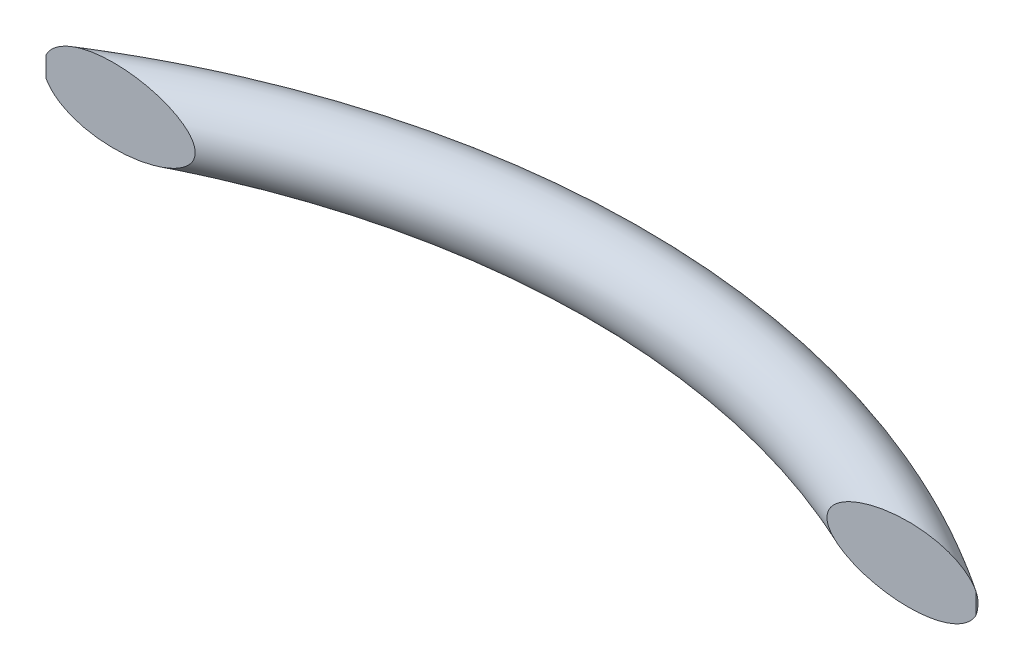
ISO-10303-21;
HEADER;
FILE_DESCRIPTION(('STEP AP214'),'2;1');
FILE_NAME('part.step','',(''),(''),'','','');
FILE_SCHEMA(('AUTOMOTIVE_DESIGN { 1 0 10303 214 1 1 1 1 }'));
ENDSEC;
DATA;
#1=APPLICATION_CONTEXT('core data for automotive mechanical design processes');
#2=APPLICATION_PROTOCOL_DEFINITION('international standard','automotive_design',2000,#1);
#3=PRODUCT_CONTEXT('',#1,'mechanical');
#4=PRODUCT('Part','Part','',(#3));
#5=PRODUCT_RELATED_PRODUCT_CATEGORY('part','',(#4));
#6=PRODUCT_DEFINITION_FORMATION('','',#4);
#7=PRODUCT_DEFINITION_CONTEXT('part definition',#1,'design');
#8=PRODUCT_DEFINITION('design','',#6,#7);
#9=PRODUCT_DEFINITION_SHAPE('','',#8);
#10=(LENGTH_UNIT() NAMED_UNIT(*) SI_UNIT(.MILLI.,.METRE.));
#11=(NAMED_UNIT(*) PLANE_ANGLE_UNIT() SI_UNIT($,.RADIAN.));
#12=(NAMED_UNIT(*) SI_UNIT($,.STERADIAN.) SOLID_ANGLE_UNIT());
#13=UNCERTAINTY_MEASURE_WITH_UNIT(LENGTH_MEASURE(1.E-05),#10,'distance_accuracy_value','');
#14=(GEOMETRIC_REPRESENTATION_CONTEXT(3) GLOBAL_UNCERTAINTY_ASSIGNED_CONTEXT((#13)) GLOBAL_UNIT_ASSIGNED_CONTEXT((#10,
#11,#12)) REPRESENTATION_CONTEXT('',''));
#15=CARTESIAN_POINT('',(0.,0.,0.));
#16=DIRECTION('',(0.,0.,1.));
#17=DIRECTION('',(1.,0.,0.));
#18=AXIS2_PLACEMENT_3D('',#15,#16,#17);
#19=CARTESIAN_POINT('',(-152.4,0.,227.828924436552));
#20=DIRECTION('',(0.,-1.,0.));
#21=DIRECTION('',(0.,0.,-1.));
#22=AXIS2_PLACEMENT_3D('',#19,#20,#21);
#23=TOROIDAL_SURFACE('',#22,274.101767250626,12.7);
#24=CARTESIAN_POINT('',(0.,0.,0.));
#25=DIRECTION('',(0.831183712245956,0.,0.555997874543627));
#26=DIRECTION('',(0.555997874543627,0.,-0.831183712245956));
#27=AXIS2_PLACEMENT_3D('',#24,#25,#26);
#28=CIRCLE('',#27,12.7);
#29=CARTESIAN_POINT('',(6.79625734014825,-3.44605370916953,-10.16));
#30=VERTEX_POINT('',#29);
#31=CARTESIAN_POINT('',(6.79625734014825,3.44605370916953,-10.16));
#32=VERTEX_POINT('',#31);
#33=EDGE_CURVE('E66',#30,#32,#28,.T.);
#34=ORIENTED_EDGE('',*,*,#33,.F.);
#35=CARTESIAN_POINT('',(-43.9860659170304,1.72332040623584,-10.16));
#36=CARTESIAN_POINT('',(-43.9151591368676,1.93793154993896,-10.16));
#37=CARTESIAN_POINT('',(-43.8321098359539,2.1485509703383,-10.16));
#38=CARTESIAN_POINT('',(-43.6450618763338,2.56038122716442,-10.16));
#39=CARTESIAN_POINT('',(-43.54104255287,2.76158253969163,-10.16));
#40=CARTESIAN_POINT('',(-43.3148902823946,3.15474442453064,-10.16));
#41=CARTESIAN_POINT('',(-43.1926727492721,3.34665598124634,-10.16));
#42=CARTESIAN_POINT('',(-42.9335346727936,3.72014091763113,-10.16));
#43=CARTESIAN_POINT('',(-42.7966162587733,3.90171578869359,-10.16));
#44=CARTESIAN_POINT('',(-42.4334334218054,4.35024692050321,-10.16));
#45=CARTESIAN_POINT('',(-42.1988085997777,4.61043564554948,-10.16));
#46=CARTESIAN_POINT('',(-41.7078314749956,5.10943785089926,-10.16));
#47=CARTESIAN_POINT('',(-41.451464040657,5.34823620312978,-10.16));
#48=CARTESIAN_POINT('',(-40.9219775957131,5.80680228364425,-10.16));
#49=CARTESIAN_POINT('',(-40.6488447892655,6.026553970308,-10.16));
#50=CARTESIAN_POINT('',(-40.0897632927793,6.44885281882681,-10.16));
#51=CARTESIAN_POINT('',(-39.8038170667507,6.6514032669607,-10.16));
#52=CARTESIAN_POINT('',(-39.2121100693396,7.04760669286929,-10.16));
#53=CARTESIAN_POINT('',(-38.9060068227333,7.24074569657723,-10.16));
#54=CARTESIAN_POINT('',(-38.2849950425226,7.61239038647729,-10.16));
#55=CARTESIAN_POINT('',(-37.9700846038726,7.79089287335898,-10.16));
#56=CARTESIAN_POINT('',(-37.3328535605271,8.13475925411668,-10.16));
#57=CARTESIAN_POINT('',(-37.0105269241695,8.30011192834147,-10.16));
#58=CARTESIAN_POINT('',(-36.3599647278674,8.61865275857517,-10.16));
#59=CARTESIAN_POINT('',(-36.0317295628914,8.77184172401665,-10.16));
#60=CARTESIAN_POINT('',(-35.3694114108312,9.06740573493296,-10.16));
#61=CARTESIAN_POINT('',(-35.035315417285,9.20975156976785,-10.16));
#62=CARTESIAN_POINT('',(-34.3628702995066,9.48396818006798,-10.16));
#63=CARTESIAN_POINT('',(-34.024521161244,9.61583892096744,-10.16));
#64=CARTESIAN_POINT('',(-33.0042545251264,9.99666502218188,-10.16));
#65=CARTESIAN_POINT('',(-32.3168260211258,10.230962729269,-10.16));
#66=CARTESIAN_POINT('',(-30.9563142608716,10.6564644772912,-10.16));
#67=CARTESIAN_POINT('',(-30.2836195026654,10.8489265830219,-10.16));
#68=CARTESIAN_POINT('',(-28.9302064191093,11.2035965730994,-10.16));
#69=CARTESIAN_POINT('',(-28.2494868486793,11.3657996951781,-10.16));
#70=CARTESIAN_POINT('',(-26.8813206774544,11.6616384734943,-10.16));
#71=CARTESIAN_POINT('',(-26.1938690962563,11.7952509957207,-10.16));
#72=CARTESIAN_POINT('',(-24.8142003671041,12.0347326494216,-10.16));
#73=CARTESIAN_POINT('',(-24.121983479051,12.1406032818334,-10.16));
#74=CARTESIAN_POINT('',(-22.7337397814987,12.325135553889,-10.16));
#75=CARTESIAN_POINT('',(-22.0377119564872,12.403789542774,-10.16));
#76=CARTESIAN_POINT('',(-20.6431014339891,12.5339243707856,-10.16));
#77=CARTESIAN_POINT('',(-19.9445186597025,12.5854043862097,-10.16));
#78=CARTESIAN_POINT('',(-18.5462797510817,12.6608577268042,-10.16));
#79=CARTESIAN_POINT('',(-17.8466245255034,12.6848477272,-10.16));
#80=CARTESIAN_POINT('',(-16.4469871785259,12.7046953086743,-10.16));
#81=CARTESIAN_POINT('',(-15.7470050838209,12.7005548842434,-10.16));
#82=CARTESIAN_POINT('',(-14.0909133584659,12.656244594436,-10.16));
#83=CARTESIAN_POINT('',(-13.1350805207458,12.6034101431366,-10.16));
#84=CARTESIAN_POINT('',(-11.7051292411154,12.4803525552711,-10.16));
#85=CARTESIAN_POINT('',(-11.2290389659515,12.4320215828035,-10.16));
#86=CARTESIAN_POINT('',(-10.2786675832716,12.3200854693027,-10.16));
#87=CARTESIAN_POINT('',(-9.80438634305612,12.2564814713773,-10.16));
#88=CARTESIAN_POINT('',(-8.85948481264155,12.1134298444174,-10.16));
#89=CARTESIAN_POINT('',(-8.38885818638365,12.0340241626565,-10.16));
#90=CARTESIAN_POINT('',(-7.45075610069653,11.8583762637566,-10.16));
#91=CARTESIAN_POINT('',(-6.98328055648004,11.7621345015252,-10.16));
#92=CARTESIAN_POINT('',(-6.05261034574045,11.5518292385272,-10.16));
#93=CARTESIAN_POINT('',(-5.58941344801258,11.4377756551907,-10.16));
#94=CARTESIAN_POINT('',(-4.66807265734835,11.1905781470397,-10.16));
#95=CARTESIAN_POINT('',(-4.20992928124423,11.0574322887674,-10.16));
#96=CARTESIAN_POINT('',(-3.26330400623098,10.7590449525582,-10.16));
#97=CARTESIAN_POINT('',(-2.77536184941966,10.5920793998648,-10.16));
#98=CARTESIAN_POINT('',(-1.80924922340093,10.2321239940231,-10.16));
#99=CARTESIAN_POINT('',(-1.33107642105726,10.0391404402214,-10.16));
#100=CARTESIAN_POINT('',(-0.387116209137769,9.62459139171867,-10.16));
#101=CARTESIAN_POINT('',(0.0786690884554549,9.40302106037643,-10.16));
#102=CARTESIAN_POINT('',(0.993954165619388,8.92844092142951,-10.16));
#103=CARTESIAN_POINT('',(1.44345821880779,8.67543944247946,-10.16));
#104=CARTESIAN_POINT('',(2.20616281472828,8.20546787058969,-10.16));
#105=CARTESIAN_POINT('',(2.52423600141944,7.99640816071473,-10.16));
#106=CARTESIAN_POINT('',(3.14607293591456,7.55782515858815,-10.16));
#107=CARTESIAN_POINT('',(3.44983550674207,7.32830018764635,-10.16));
#108=CARTESIAN_POINT('',(4.03913091252961,6.84765407947948,-10.16));
#109=CARTESIAN_POINT('',(4.32469137692471,6.59656710084721,-10.16));
#110=CARTESIAN_POINT('',(4.87351980862472,6.07135066389732,-10.16));
#111=CARTESIAN_POINT('',(5.13679822557976,5.79723212827661,-10.16));
#112=CARTESIAN_POINT('',(5.718945835868,5.12926750741816,-10.16));
#113=CARTESIAN_POINT('',(6.02723683300713,4.72589401658429,-10.16));
#114=CARTESIAN_POINT('',(6.44027366497001,4.08932573260781,-10.16));
#115=CARTESIAN_POINT('',(6.56969653159626,3.87193570954763,-10.16));
#116=CARTESIAN_POINT('',(6.80987732888779,3.42700932899236,-10.16));
#117=CARTESIAN_POINT('',(6.92063849776986,3.19947474048685,-10.16));
#118=CARTESIAN_POINT('',(7.10437978437762,2.77394179718461,-10.16));
#119=CARTESIAN_POINT('',(7.18057984764729,2.57733083948272,-10.16));
#120=CARTESIAN_POINT('',(7.31698964363037,2.17864952774648,-10.16));
#121=CARTESIAN_POINT('',(7.37720276069435,1.97658033918527,-10.16));
#122=CARTESIAN_POINT('',(7.48043746063096,1.56818798458004,-10.16));
#123=CARTESIAN_POINT('',(7.52346775031487,1.36186702885322,-10.16));
#124=CARTESIAN_POINT('',(7.59145203579069,0.946251282761808,-10.16));
#125=CARTESIAN_POINT('',(7.61640591323013,0.736956472935529,-10.16));
#126=CARTESIAN_POINT('',(7.64771267370316,0.316292588106167,-10.16));
#127=CARTESIAN_POINT('',(7.65400521402432,0.104918996733764,-10.16));
#128=CARTESIAN_POINT('',(7.64766802248694,-0.317543288550641,-10.16));
#129=CARTESIAN_POINT('',(7.63503824014096,-0.528631981700991,-10.16));
#130=CARTESIAN_POINT('',(7.59114963245554,-0.948911372590826,-10.16));
#131=CARTESIAN_POINT('',(7.55988574535755,-1.15810153893468,-10.16));
#132=CARTESIAN_POINT('',(7.47943638038491,-1.57299086606787,-10.16));
#133=CARTESIAN_POINT('',(7.43025082624511,-1.77869001199737,-10.16));
#134=CARTESIAN_POINT('',(7.31745148494481,-2.17662764522463,-10.16));
#135=CARTESIAN_POINT('',(7.25454062032346,-2.36906647544918,-10.16));
#136=CARTESIAN_POINT('',(7.11434206300426,-2.74866256805793,-10.16));
#137=CARTESIAN_POINT('',(7.03704994216359,-2.93581818318595,-10.16));
#138=CARTESIAN_POINT('',(6.78544387767614,-3.48814819229802,-10.16));
#139=CARTESIAN_POINT('',(6.59134224444772,-3.84438357017858,-10.16));
#140=CARTESIAN_POINT('',(6.03509730244911,-4.72844919594624,-10.16));
#141=CARTESIAN_POINT('',(5.64077317107057,-5.23601953946797,-10.16));
#142=CARTESIAN_POINT('',(4.99396751643365,-5.94579250739507,-10.16));
#143=CARTESIAN_POINT('',(4.76870032189221,-6.17414250894897,-10.16));
#144=CARTESIAN_POINT('',(4.30259082411884,-6.61445240460085,-10.16));
#145=CARTESIAN_POINT('',(4.06174901990023,-6.82641282334675,-10.16));
#146=CARTESIAN_POINT('',(3.41264316813798,-7.36227525633257,-10.16));
#147=CARTESIAN_POINT('',(2.99380347426541,-7.67336156260666,-10.16));
#148=CARTESIAN_POINT('',(2.13073390938118,-8.25814274724838,-10.16));
#149=CARTESIAN_POINT('',(1.68648780954418,-8.53181333856054,-10.16));
#150=CARTESIAN_POINT('',(0.778309351503332,-9.04562983239116,-10.16));
#151=CARTESIAN_POINT('',(0.314349822632633,-9.28572736954457,-10.16));
#152=CARTESIAN_POINT('',(-0.628059494106528,-9.73516567913688,-10.16));
#153=CARTESIAN_POINT('',(-1.10650748041298,-9.94451025675432,-10.16));
#154=CARTESIAN_POINT('',(-2.02400046254638,-10.3148560522205,-10.16));
#155=CARTESIAN_POINT('',(-2.46193818175549,-10.478623064942,-10.16));
#156=CARTESIAN_POINT('',(-3.34503894760928,-10.7855175238214,-10.16));
#157=CARTESIAN_POINT('',(-3.79020313735707,-10.928641668532,-10.16));
#158=CARTESIAN_POINT('',(-4.6865097219152,-11.1957843525788,-10.16));
#159=CARTESIAN_POINT('',(-5.13765574009842,-11.3197906782179,-10.16));
#160=CARTESIAN_POINT('',(-6.0444594921957,-11.5498565831517,-10.16));
#161=CARTESIAN_POINT('',(-6.50011702273078,-11.6559169675853,-10.16));
#162=CARTESIAN_POINT('',(-7.41611811749422,-11.8514270197025,-10.16));
#163=CARTESIAN_POINT('',(-7.87647031625837,-11.9408361240628,-10.16));
#164=CARTESIAN_POINT('',(-8.79996495176496,-12.1036606180845,-10.16));
#165=CARTESIAN_POINT('',(-9.26310738841545,-12.177076008273,-10.16));
#166=CARTESIAN_POINT('',(-10.6555192693163,-12.3745460854123,-10.16));
#167=CARTESIAN_POINT('',(-11.5880956005148,-12.475892067429,-10.16));
#168=CARTESIAN_POINT('',(-13.2514662198607,-12.6068183632712,-10.16));
#169=CARTESIAN_POINT('',(-13.981459421815,-12.6472893163541,-10.16));
#170=CARTESIAN_POINT('',(-15.4426089338217,-12.6961881279556,-10.16));
#171=CARTESIAN_POINT('',(-16.1737653559314,-12.7046126855479,-10.16));
#172=CARTESIAN_POINT('',(-17.6362714000023,-12.6906667824738,-10.16));
#173=CARTESIAN_POINT('',(-18.3676207995576,-12.6682747842187,-10.16));
#174=CARTESIAN_POINT('',(-19.8287490050975,-12.5934690176149,-10.16));
#175=CARTESIAN_POINT('',(-20.5585278722671,-12.541056440868,-10.16));
#176=CARTESIAN_POINT('',(-22.0150174806248,-12.4066128324297,-10.16));
#177=CARTESIAN_POINT('',(-22.7417294616108,-12.3245952248807,-10.16));
#178=CARTESIAN_POINT('',(-24.191227981182,-12.1308487163243,-10.16));
#179=CARTESIAN_POINT('',(-24.9140143132268,-12.0191182671921,-10.16));
#180=CARTESIAN_POINT('',(-26.3536954895575,-11.7654587592351,-10.16));
#181=CARTESIAN_POINT('',(-27.070594524778,-11.6235535487301,-10.16));
#182=CARTESIAN_POINT('',(-28.4973750175534,-11.3083313549272,-10.16));
#183=CARTESIAN_POINT('',(-29.2072575083119,-11.135019071316,-10.16));
#184=CARTESIAN_POINT('',(-30.6035063538969,-10.7589593528693,-10.16));
#185=CARTESIAN_POINT('',(-31.2900556892424,-10.5568931390033,-10.16));
#186=CARTESIAN_POINT('',(-32.6521715438723,-10.117997219913,-10.16));
#187=CARTESIAN_POINT('',(-33.3277368071272,-9.88116356965441,-10.16));
#188=CARTESIAN_POINT('',(-34.3288884313763,-9.49725671089733,-10.16));
#189=CARTESIAN_POINT('',(-34.6600910034282,-9.3647292391337,-10.16));
#190=CARTESIAN_POINT('',(-35.3181743863455,-9.08936977961431,-10.16));
#191=CARTESIAN_POINT('',(-35.645055529188,-8.94653858890931,-10.16));
#192=CARTESIAN_POINT('',(-36.2936187970556,-8.64984321118786,-10.16));
#193=CARTESIAN_POINT('',(-36.6153030240662,-8.4959836290265,-10.16));
#194=CARTESIAN_POINT('',(-37.2526116460362,-8.17624183920367,-10.16));
#195=CARTESIAN_POINT('',(-37.5682368162793,-8.01036118283892,-10.16));
#196=CARTESIAN_POINT('',(-38.1696371364296,-7.67789074898923,-10.16));
#197=CARTESIAN_POINT('',(-38.455919570099,-7.51222092313592,-10.16));
#198=CARTESIAN_POINT('',(-39.0209354955231,-7.16842037594594,-10.16));
#199=CARTESIAN_POINT('',(-39.2996689873005,-6.99028965464676,-10.16));
#200=CARTESIAN_POINT('',(-39.8482005013995,-6.62004297108496,-10.16));
#201=CARTESIAN_POINT('',(-40.1179877780416,-6.42791101788665,-10.16));
#202=CARTESIAN_POINT('',(-40.6459864948139,-6.02831685388584,-10.16));
#203=CARTESIAN_POINT('',(-40.9041996265921,-5.82085689520199,-10.16));
#204=CARTESIAN_POINT('',(-41.3641100519765,-5.42486129904529,-10.16));
#205=CARTESIAN_POINT('',(-41.5680508896162,-5.23893977847515,-10.16));
#206=CARTESIAN_POINT('',(-41.9633977657434,-4.8540686044674,-10.16));
#207=CARTESIAN_POINT('',(-42.15480163233,-4.65511670552772,-10.16));
#208=CARTESIAN_POINT('',(-42.5214883110327,-4.24359456819732,-10.16));
#209=CARTESIAN_POINT('',(-42.6968085710012,-4.03105802542519,-10.16));
#210=CARTESIAN_POINT('',(-43.0276990270036,-3.59130080185747,-10.16));
#211=CARTESIAN_POINT('',(-43.1832823005549,-3.36408999630349,-10.16));
#212=CARTESIAN_POINT('',(-43.5028854383104,-2.84023267986361,-10.16));
#213=CARTESIAN_POINT('',(-43.6606345785675,-2.53962474375462,-10.16));
#214=CARTESIAN_POINT('',(-43.8608766635043,-2.07330315090117,-10.16));
#215=CARTESIAN_POINT('',(-43.9215629059352,-1.91528464633724,-10.16));
#216=CARTESIAN_POINT('',(-44.0294345039723,-1.59473455231035,-10.16));
#217=CARTESIAN_POINT('',(-44.0766265351106,-1.43220523813565,-10.16));
#218=CARTESIAN_POINT('',(-44.1566722736449,-1.10180453778704,-10.16));
#219=CARTESIAN_POINT('',(-44.1893684838876,-0.933894761705609,-10.16));
#220=CARTESIAN_POINT('',(-44.2386701362728,-0.595699097844061,-10.16));
#221=CARTESIAN_POINT('',(-44.2552746549825,-0.425413074270108,-10.16));
#222=CARTESIAN_POINT('',(-44.2718215472464,-0.0841911405027359,-10.16));
#223=CARTESIAN_POINT('',(-44.2717798815232,0.0867439900169605,-10.16));
#224=CARTESIAN_POINT('',(-44.2550789739346,0.427729706837518,-10.16));
#225=CARTESIAN_POINT('',(-44.2384260501569,0.597780604736662,-10.16));
#226=CARTESIAN_POINT('',(-44.1900079065459,0.929112271993255,-10.16));
#227=CARTESIAN_POINT('',(-44.1588395383276,1.09048112232215,-10.16));
#228=CARTESIAN_POINT('',(-44.0825927088192,1.40970554847333,-10.16));
#229=CARTESIAN_POINT('',(-44.037527211974,1.5675642523262,-10.16));
#230=CARTESIAN_POINT('',(-43.9860659170304,1.72332040623584,-10.16));
#231=B_SPLINE_CURVE_WITH_KNOTS('',3,(#35,#36,#37,#38,#39,#40,#41,#42,#43,#44,#45,#46,#47,#48,
#49,#50,#51,#52,#53,#54,#55,#56,#57,#58,#59,#60,#61,#62,#63,#64,#65,#66,#67,#68,#69,#70,#71,#72,
#73,#74,#75,#76,#77,#78,#79,#80,#81,#82,#83,#84,#85,#86,#87,#88,#89,#90,#91,#92,#93,#94,#95,#96,
#97,#98,#99,#100,#101,#102,#103,#104,#105,#106,#107,#108,#109,#110,#111,#112,#113,#114,#115,
#116,#117,#118,#119,#120,#121,#122,#123,#124,#125,#126,#127,#128,#129,#130,#131,#132,#133,#134,
#135,#136,#137,#138,#139,#140,#141,#142,#143,#144,#145,#146,#147,#148,#149,#150,#151,#152,#153,
#154,#155,#156,#157,#158,#159,#160,#161,#162,#163,#164,#165,#166,#167,#168,#169,#170,#171,#172,
#173,#174,#175,#176,#177,#178,#179,#180,#181,#182,#183,#184,#185,#186,#187,#188,#189,#190,#191,
#192,#193,#194,#195,#196,#197,#198,#199,#200,#201,#202,#203,#204,#205,#206,#207,#208,#209,#210,
#211,#212,#213,#214,#215,#216,#217,#218,#219,#220,#221,#222,#223,#224,#225,#226,#227,#228,#229,
#230),.UNSPECIFIED.,.T.,.F.,(4,2,2,2,2,2,2,2,2,2,2,2,2,2,2,2,2,2,2,2,2,2,2,2,2,2,2,2,2,2,2,2,2,
2,2,2,2,2,2,2,2,2,2,2,2,2,2,2,2,2,2,2,2,2,2,2,2,2,2,2,2,2,2,2,2,2,2,2,2,2,2,2,2,2,2,2,2,2,2,2,2,
2,2,2,2,2,2,2,2,2,2,2,2,2,2,2,2,4),(0.,0.677819836138931,1.35631091903076,2.03806023873624,
2.71971094396366,3.76899850988894,4.81902240681276,5.86992223888205,6.92062084382111,
8.00598212527661,9.09158002054046,10.1780944451543,11.264536507094,12.3538088286615,
13.4430847444679,15.6206816410561,17.7190231735498,19.8176946724992,21.9180579380391,
24.0183075428047,26.1191470614099,28.2200502573899,30.3196783863942,32.4191576500771,
35.2891108480311,36.724528530677,38.1598388131056,39.5913885509409,41.0228996145551,
42.4536164513947,43.8844782781364,45.430955101648,46.97705817019,48.523423170186,
50.0693792834569,51.2105580697711,52.3518305490546,53.4913272468848,54.630286557088,
56.1475210701953,56.9058082809772,57.6639637763617,58.2959288781209,58.9277600894035,
59.559270734279,60.1907855138337,60.8243401251432,61.4578964268687,62.091624905984,
62.7253560819443,63.3321236763693,63.9390784111454,65.1523756132398,67.0691207341605,
68.030883972735,68.9926164114932,70.5553195149947,72.1190322227695,73.6849749059436,
75.2507236656831,76.6528486437959,78.0551976179544,79.4584388233381,80.8616170560409,
82.2681700220115,83.6747229416303,86.4868428701518,88.6795362766408,90.8724555345418,
93.0669081950062,95.2612737574565,97.4546455514139,99.6481316487782,101.839890547404,
104.031321746365,106.177530983973,108.323983938801,109.39404299195,110.464019358577,
111.533551535091,112.602945935458,113.594954909211,114.586963879979,115.580124147542,
116.57313878078,117.400544388178,118.228092958009,119.05366304184,119.878683222425,
120.893206744859,121.400527849238,121.907597547985,122.420049075363,122.932530008379,
123.444519564743,123.956314460241,124.448706854302,124.940641284634),.UNSPECIFIED.);
#232=EDGE_CURVE('E56',#30,#32,#231,.T.);
#233=ORIENTED_EDGE('',*,*,#232,.T.);
#234=EDGE_LOOP('',(#34,#233));
#235=FACE_BOUND('',#234,.T.);
#236=CARTESIAN_POINT('',(-304.8,0.,0.));
#237=DIRECTION('',(0.831183712245956,0.,-0.555997874543628));
#238=DIRECTION('',(-0.555997874543628,0.,-0.831183712245956));
#239=AXIS2_PLACEMENT_3D('',#236,#237,#238);
#240=CIRCLE('',#239,12.7);
#241=CARTESIAN_POINT('',(-311.596257340148,-3.44605370916948,-10.16));
#242=VERTEX_POINT('',#241);
#243=CARTESIAN_POINT('',(-311.596257340148,3.44605370916948,-10.16));
#244=VERTEX_POINT('',#243);
#245=EDGE_CURVE('E43',#242,#244,#240,.T.);
#246=ORIENTED_EDGE('',*,*,#245,.T.);
#247=CARTESIAN_POINT('',(-306.366070989677,-8.59581999438654,-10.16));
#248=CARTESIAN_POINT('',(-306.702633814368,-8.39698533019598,-10.16));
#249=CARTESIAN_POINT('',(-307.033435855686,-8.1883887763751,-10.16));
#250=CARTESIAN_POINT('',(-307.680850323093,-7.75005868059673,-10.16));
#251=CARTESIAN_POINT('',(-307.997462023884,-7.52032406005558,-10.16));
#252=CARTESIAN_POINT('',(-308.612474477266,-7.0385066157049,-10.16));
#253=CARTESIAN_POINT('',(-308.910903531663,-6.78646010333964,-10.16));
#254=CARTESIAN_POINT('',(-309.485567630244,-6.25821670825318,-10.16));
#255=CARTESIAN_POINT('',(-309.761812845373,-5.98203101567727,-10.16));
#256=CARTESIAN_POINT('',(-310.19731498733,-5.5025065190272,-10.16));
#257=CARTESIAN_POINT('',(-310.364436429484,-5.30629040863854,-10.16));
#258=CARTESIAN_POINT('',(-310.68464152879,-4.90258323197704,-10.16));
#259=CARTESIAN_POINT('',(-310.83772215217,-4.69508974437393,-10.16));
#260=CARTESIAN_POINT('',(-311.127454274681,-4.26914276100983,-10.16));
#261=CARTESIAN_POINT('',(-311.264119400467,-4.05069857205996,-10.16));
#262=CARTESIAN_POINT('',(-311.518673584198,-3.60323108550729,-10.16));
#263=CARTESIAN_POINT('',(-311.636574087512,-3.37421434740221,-10.16));
#264=CARTESIAN_POINT('',(-311.832532463882,-2.9470059046116,-10.16));
#265=CARTESIAN_POINT('',(-311.913954048812,-2.75035603027335,-10.16));
#266=CARTESIAN_POINT('',(-312.06086775919,-2.35126661467209,-10.16));
#267=CARTESIAN_POINT('',(-312.126367562849,-2.1488299169306,-10.16));
#268=CARTESIAN_POINT('',(-312.240180037716,-1.73925938177325,-10.16));
#269=CARTESIAN_POINT('',(-312.288500487989,-1.53212771562233,-10.16));
#270=CARTESIAN_POINT('',(-312.366956822972,-1.1144297013366,-10.16));
#271=CARTESIAN_POINT('',(-312.397092609767,-0.903863334713727,-10.16));
#272=CARTESIAN_POINT('',(-312.438563412143,-0.480039892091891,-10.16));
#273=CARTESIAN_POINT('',(-312.449823963115,-0.266775487688768,-10.16));
#274=CARTESIAN_POINT('',(-312.453041103452,0.159899942851791,-10.16));
#275=CARTESIAN_POINT('',(-312.444997651234,0.373310969304084,-10.16));
#276=CARTESIAN_POINT('',(-312.409797761771,0.798593085812662,-10.16));
#277=CARTESIAN_POINT('',(-312.382636812039,1.01046380036291,-10.16));
#278=CARTESIAN_POINT('',(-312.309836413047,1.43098910284861,-10.16));
#279=CARTESIAN_POINT('',(-312.264197035201,1.63964370321055,-10.16));
#280=CARTESIAN_POINT('',(-312.158427180236,2.04099710738788,-10.16));
#281=CARTESIAN_POINT('',(-312.09922962274,2.23394306841978,-10.16));
#282=CARTESIAN_POINT('',(-311.96628851858,2.6147694455527,-10.16));
#283=CARTESIAN_POINT('',(-311.892540530329,2.802648294939,-10.16));
#284=CARTESIAN_POINT('',(-311.651204426752,3.35748608108545,-10.16));
#285=CARTESIAN_POINT('',(-311.463467975082,3.71585234074584,-10.16));
#286=CARTESIAN_POINT('',(-311.091029845256,4.32867507090775,-10.16));
#287=CARTESIAN_POINT('',(-310.914935693039,4.58851793870516,-10.16));
#288=CARTESIAN_POINT('',(-310.540456625571,5.091688431861,-10.16));
#289=CARTESIAN_POINT('',(-310.34206635855,5.33501206950463,-10.16));
#290=CARTESIAN_POINT('',(-309.926252798461,5.80572340169728,-10.16));
#291=CARTESIAN_POINT('',(-309.708785375577,6.03307183296381,-10.16));
#292=CARTESIAN_POINT('',(-309.25836348961,6.47175160006939,-10.16));
#293=CARTESIAN_POINT('',(-309.025409403067,6.68308332506838,-10.16));
#294=CARTESIAN_POINT('',(-308.399487310454,7.21568534195848,-10.16));
#295=CARTESIAN_POINT('',(-307.996114889567,7.52476133938593,-10.16));
#296=CARTESIAN_POINT('',(-307.164089084687,8.10681191392652,-10.16));
#297=CARTESIAN_POINT('',(-306.735419799581,8.37976342675842,-10.16));
#298=CARTESIAN_POINT('',(-305.858427451915,8.89320796684691,-10.16));
#299=CARTESIAN_POINT('',(-305.41007917242,9.13365763594001,-10.16));
#300=CARTESIAN_POINT('',(-304.498795386079,9.58473697994687,-10.16));
#301=CARTESIAN_POINT('',(-304.035861626232,9.79537020969648,-10.16));
#302=CARTESIAN_POINT('',(-303.148431822123,10.1686088721836,-10.16));
#303=CARTESIAN_POINT('',(-302.725072650542,10.3339391208776,-10.16));
#304=CARTESIAN_POINT('',(-301.87103775549,10.6446287398736,-10.16));
#305=CARTESIAN_POINT('',(-301.440360874871,10.7899849180259,-10.16));
#306=CARTESIAN_POINT('',(-300.572929165282,11.0622082747351,-10.16));
#307=CARTESIAN_POINT('',(-300.136170658767,11.189063682164,-10.16));
#308=CARTESIAN_POINT('',(-299.258019215116,11.4254038196235,-10.16));
#309=CARTESIAN_POINT('',(-298.816626485816,11.5348893251464,-10.16));
#310=CARTESIAN_POINT('',(-297.928775690497,11.7378696178911,-10.16));
#311=CARTESIAN_POINT('',(-297.482306298406,11.8313147351591,-10.16));
#312=CARTESIAN_POINT('',(-296.586393776178,12.0027276823286,-10.16));
#313=CARTESIAN_POINT('',(-296.136950385986,12.0806941397471,-10.16));
#314=CARTESIAN_POINT('',(-294.785442438107,12.2925484301076,-10.16));
#315=CARTESIAN_POINT('',(-293.87985309915,12.4044689611805,-10.16));
#316=CARTESIAN_POINT('',(-292.248891903955,12.557353131513,-10.16));
#317=CARTESIAN_POINT('',(-291.524389994234,12.6081272318336,-10.16));
#318=CARTESIAN_POINT('',(-290.073756870561,12.6775530085005,-10.16));
#319=CARTESIAN_POINT('',(-289.347625485324,12.696201132652,-10.16));
#320=CARTESIAN_POINT('',(-287.894736725374,12.7027541077849,-10.16));
#321=CARTESIAN_POINT('',(-287.167979271061,12.6906372125523,-10.16));
#322=CARTESIAN_POINT('',(-285.715613804431,12.6365548302469,-10.16));
#323=CARTESIAN_POINT('',(-284.990005743634,12.594590637599,-10.16));
#324=CARTESIAN_POINT('',(-283.543898922933,12.4815464323518,-10.16));
#325=CARTESIAN_POINT('',(-282.82339126302,12.4105800482025,-10.16));
#326=CARTESIAN_POINT('',(-281.385784239656,12.2396104744876,-10.16));
#327=CARTESIAN_POINT('',(-280.668685062006,12.1396057200381,-10.16));
#328=CARTESIAN_POINT('',(-279.239768399948,11.9102639604397,-10.16));
#329=CARTESIAN_POINT('',(-278.527947184361,11.7809502341478,-10.16));
#330=CARTESIAN_POINT('',(-277.110554205294,11.492048011649,-10.16));
#331=CARTESIAN_POINT('',(-276.404981449808,11.332464414663,-10.16));
#332=CARTESIAN_POINT('',(-275.192659291263,11.029170927558,-10.16));
#333=CARTESIAN_POINT('',(-274.684028865766,10.8929491917228,-10.16));
#334=CARTESIAN_POINT('',(-273.671884892219,10.6027214062056,-10.16));
#335=CARTESIAN_POINT('',(-273.168370960914,10.448716699415,-10.16));
#336=CARTESIAN_POINT('',(-272.165206114822,10.1209795886306,-10.16));
#337=CARTESIAN_POINT('',(-271.665583920855,9.94715905820767,-10.16));
#338=CARTESIAN_POINT('',(-270.674021712214,9.57879440902127,-10.16));
#339=CARTESIAN_POINT('',(-270.182081172611,9.38425171348677,-10.16));
#340=CARTESIAN_POINT('',(-269.383603157904,9.04665756612073,-10.16));
#341=CARTESIAN_POINT('',(-269.074206057267,8.91035017499669,-10.16));
#342=CARTESIAN_POINT('',(-268.459997580276,8.62770557805796,-10.16));
#343=CARTESIAN_POINT('',(-268.155186356968,8.48136803840204,-10.16));
#344=CARTESIAN_POINT('',(-267.550627711152,8.17766838444136,-10.16));
#345=CARTESIAN_POINT('',(-267.250886891765,8.02029309014133,-10.16));
#346=CARTESIAN_POINT('',(-266.657924510612,7.69369707472463,-10.16));
#347=CARTESIAN_POINT('',(-266.364702627731,7.52447693878471,-10.16));
#348=CARTESIAN_POINT('',(-265.788512200277,7.17444533051565,-10.16));
#349=CARTESIAN_POINT('',(-265.505479360778,6.99374011094158,-10.16));
#350=CARTESIAN_POINT('',(-264.948881389147,6.6180978005915,-10.16));
#351=CARTESIAN_POINT('',(-264.675318235728,6.42315776156172,-10.16));
#352=CARTESIAN_POINT('',(-264.140762294322,6.01796381727447,-10.16));
#353=CARTESIAN_POINT('',(-263.879740671209,5.80774813770566,-10.16));
#354=CARTESIAN_POINT('',(-263.372896779653,5.36984895147738,-10.16));
#355=CARTESIAN_POINT('',(-263.127064656889,5.14217698924501,-10.16));
#356=CARTESIAN_POINT('',(-262.754813860543,4.76777045335893,-10.16));
#357=CARTESIAN_POINT('',(-262.62185568991,4.62751869398289,-10.16));
#358=CARTESIAN_POINT('',(-262.363554441243,4.34013458629649,-10.16));
#359=CARTESIAN_POINT('',(-262.238211328029,4.1930022697774,-10.16));
#360=CARTESIAN_POINT('',(-261.9963449624,3.8914023982221,-10.16));
#361=CARTESIAN_POINT('',(-261.879830077282,3.73692810466994,-10.16));
#362=CARTESIAN_POINT('',(-261.657307662656,3.42054529621351,-10.16));
#363=CARTESIAN_POINT('',(-261.551300333718,3.25863663948671,-10.16));
#364=CARTESIAN_POINT('',(-261.350299197141,2.92518165696403,-10.16));
#365=CARTESIAN_POINT('',(-261.2554673473,2.75353706315208,-10.16));
#366=CARTESIAN_POINT('',(-261.080580284856,2.40289074238999,-10.16));
#367=CARTESIAN_POINT('',(-261.000520425065,2.22389135096065,-10.16));
#368=CARTESIAN_POINT('',(-260.857505156223,1.85954701998241,-10.16));
#369=CARTESIAN_POINT('',(-260.794515989326,1.67421543250342,-10.16));
#370=CARTESIAN_POINT('',(-260.68757243688,1.29814003460908,-10.16));
#371=CARTESIAN_POINT('',(-260.643611095375,1.10739822921127,-10.16));
#372=CARTESIAN_POINT('',(-260.584126257114,0.766534942285125,-10.16));
#373=CARTESIAN_POINT('',(-260.56439136752,0.61713957449571,-10.16));
#374=CARTESIAN_POINT('',(-260.537709352358,0.317218881741149,-10.16));
#375=CARTESIAN_POINT('',(-260.530760110916,0.16669374787956,-10.16));
#376=CARTESIAN_POINT('',(-260.529834003845,-0.134375799208813,-10.16));
#377=CARTESIAN_POINT('',(-260.535855547278,-0.284920207806719,-10.16));
#378=CARTESIAN_POINT('',(-260.560705460026,-0.584948814559434,-10.16));
#379=CARTESIAN_POINT('',(-260.579534461642,-0.734432960001107,-10.16));
#380=CARTESIAN_POINT('',(-260.62942123553,-1.03072601391963,-10.16));
#381=CARTESIAN_POINT('',(-260.660430127125,-1.17754319137327,-10.16));
#382=CARTESIAN_POINT('',(-260.733946560281,-1.46829198583703,-10.16));
#383=CARTESIAN_POINT('',(-260.776458052037,-1.61222259327569,-10.16));
#384=CARTESIAN_POINT('',(-260.919940266762,-2.03865926157427,-10.16));
#385=CARTESIAN_POINT('',(-261.036866740248,-2.31585519846069,-10.16));
#386=CARTESIAN_POINT('',(-261.382176470046,-3.00660874101833,-10.16));
#387=CARTESIAN_POINT('',(-261.636041216063,-3.40734733437389,-10.16));
#388=CARTESIAN_POINT('',(-262.060201002682,-3.97521896711278,-10.16));
#389=CARTESIAN_POINT('',(-262.209134161221,-4.15928311894166,-10.16));
#390=CARTESIAN_POINT('',(-262.519078539818,-4.51696573102817,-10.16));
#391=CARTESIAN_POINT('',(-262.680087552167,-4.69058609021168,-10.16));
#392=CARTESIAN_POINT('',(-263.147070832093,-5.16530141731765,-10.16));
#393=CARTESIAN_POINT('',(-263.464419240479,-5.45519520888146,-10.16));
#394=CARTESIAN_POINT('',(-264.122648073249,-6.00699539943628,-10.16));
#395=CARTESIAN_POINT('',(-264.463548560419,-6.26887744054861,-10.16));
#396=CARTESIAN_POINT('',(-265.163404411358,-6.7686673252412,-10.16));
#397=CARTESIAN_POINT('',(-265.522394668767,-7.00652595173749,-10.16));
#398=CARTESIAN_POINT('',(-266.25354208282,-7.46066339722399,-10.16));
#399=CARTESIAN_POINT('',(-266.625695811147,-7.67694777979916,-10.16));
#400=CARTESIAN_POINT('',(-267.40656547645,-8.10482454967993,-10.16));
#401=CARTESIAN_POINT('',(-267.81602676082,-8.31505042922408,-10.16));
#402=CARTESIAN_POINT('',(-268.64438104952,-8.71614278467624,-10.16));
#403=CARTESIAN_POINT('',(-269.063276102312,-8.90700500542329,-10.16));
#404=CARTESIAN_POINT('',(-269.90896767867,-9.2713364211935,-10.16));
#405=CARTESIAN_POINT('',(-270.335770797776,-9.44479024508064,-10.16));
#406=CARTESIAN_POINT('',(-271.195527707673,-9.77556500750079,-10.16));
#407=CARTESIAN_POINT('',(-271.628481074962,-9.93288705078643,-10.16));
#408=CARTESIAN_POINT('',(-272.500396441967,-10.2328619938039,-10.16));
#409=CARTESIAN_POINT('',(-272.939368749295,-10.3754848466485,-10.16));
#410=CARTESIAN_POINT('',(-273.821643338598,-10.6466094855797,-10.16));
#411=CARTESIAN_POINT('',(-274.264945639733,-10.7751112091469,-10.16));
#412=CARTESIAN_POINT('',(-275.155046729372,-11.0186581275346,-10.16));
#413=CARTESIAN_POINT('',(-275.60184414292,-11.1337083554811,-10.16));
#414=CARTESIAN_POINT('',(-276.498558725066,-11.3509550952733,-10.16));
#415=CARTESIAN_POINT('',(-276.94847601747,-11.4531510939129,-10.16));
#416=CARTESIAN_POINT('',(-278.121865010482,-11.7027328682119,-10.16));
#417=CARTESIAN_POINT('',(-278.847418425657,-11.840418486611,-10.16));
#418=CARTESIAN_POINT('',(-280.303719523361,-12.085069436431,-10.16));
#419=CARTESIAN_POINT('',(-281.034467693121,-12.1920318462054,-10.16));
#420=CARTESIAN_POINT('',(-282.50027616442,-12.3757844257934,-10.16));
#421=CARTESIAN_POINT('',(-283.235339161237,-12.4525531005356,-10.16));
#422=CARTESIAN_POINT('',(-284.707974445607,-12.5757952560874,-10.16));
#423=CARTESIAN_POINT('',(-285.44554664281,-12.6222698163373,-10.16));
#424=CARTESIAN_POINT('',(-286.923325868107,-12.6845034908776,-10.16));
#425=CARTESIAN_POINT('',(-287.66353524914,-12.7002071331886,-10.16));
#426=CARTESIAN_POINT('',(-289.14399559526,-12.699788730074,-10.16));
#427=CARTESIAN_POINT('',(-289.884246560766,-12.6836653156712,-10.16));
#428=CARTESIAN_POINT('',(-291.36270982811,-12.6181930180789,-10.16));
#429=CARTESIAN_POINT('',(-292.100923278794,-12.5688704042564,-10.16));
#430=CARTESIAN_POINT('',(-293.574136545989,-12.4350871049593,-10.16));
#431=CARTESIAN_POINT('',(-294.309136738564,-12.3506306490112,-10.16));
#432=CARTESIAN_POINT('',(-295.537031280884,-12.1774179731998,-10.16));
#433=CARTESIAN_POINT('',(-296.031380582642,-12.0988778631531,-10.16));
#434=CARTESIAN_POINT('',(-297.016820725545,-11.9235431348974,-10.16));
#435=CARTESIAN_POINT('',(-297.50791178942,-11.8267497780443,-10.16));
#436=CARTESIAN_POINT('',(-298.486261866961,-11.6136671162339,-10.16));
#437=CARTESIAN_POINT('',(-298.973517615032,-11.497362756703,-10.16));
#438=CARTESIAN_POINT('',(-299.942603723524,-11.2439404190571,-10.16));
#439=CARTESIAN_POINT('',(-300.424434187907,-11.1068228405036,-10.16));
#440=CARTESIAN_POINT('',(-301.378018971418,-10.8111347955444,-10.16));
#441=CARTESIAN_POINT('',(-301.849818779715,-10.6527117355703,-10.16));
#442=CARTESIAN_POINT('',(-302.784778928916,-10.3118395095618,-10.16));
#443=CARTESIAN_POINT('',(-303.247938123699,-10.1293871817104,-10.16));
#444=CARTESIAN_POINT('',(-304.162342250728,-9.7386173742354,-10.16));
#445=CARTESIAN_POINT('',(-304.61360608138,-9.53034434832214,-10.16));
#446=CARTESIAN_POINT('',(-305.501698071933,-9.08522990440615,-10.16));
#447=CARTESIAN_POINT('',(-305.938532567638,-8.84840124322989,-10.16));
#448=CARTESIAN_POINT('',(-306.366070989677,-8.59581999438654,-10.16));
#449=B_SPLINE_CURVE_WITH_KNOTS('',3,(#247,#248,#249,#250,#251,#252,#253,#254,#255,#256,#257,
#258,#259,#260,#261,#262,#263,#264,#265,#266,#267,#268,#269,#270,#271,#272,#273,#274,#275,#276,
#277,#278,#279,#280,#281,#282,#283,#284,#285,#286,#287,#288,#289,#290,#291,#292,#293,#294,#295,
#296,#297,#298,#299,#300,#301,#302,#303,#304,#305,#306,#307,#308,#309,#310,#311,#312,#313,#314,
#315,#316,#317,#318,#319,#320,#321,#322,#323,#324,#325,#326,#327,#328,#329,#330,#331,#332,#333,
#334,#335,#336,#337,#338,#339,#340,#341,#342,#343,#344,#345,#346,#347,#348,#349,#350,#351,#352,
#353,#354,#355,#356,#357,#358,#359,#360,#361,#362,#363,#364,#365,#366,#367,#368,#369,#370,#371,
#372,#373,#374,#375,#376,#377,#378,#379,#380,#381,#382,#383,#384,#385,#386,#387,#388,#389,#390,
#391,#392,#393,#394,#395,#396,#397,#398,#399,#400,#401,#402,#403,#404,#405,#406,#407,#408,#409,
#410,#411,#412,#413,#414,#415,#416,#417,#418,#419,#420,#421,#422,#423,#424,#425,#426,#427,#428,
#429,#430,#431,#432,#433,#434,#435,#436,#437,#438,#439,#440,#441,#442,#443,#444,#445,#446,#447,
#448),.UNSPECIFIED.,.T.,.F.,(4,2,2,2,2,2,2,2,2,2,2,2,2,2,2,2,2,2,2,2,2,2,2,2,2,2,2,2,2,2,2,2,2,
2,2,2,2,2,2,2,2,2,2,2,2,2,2,2,2,2,2,2,2,2,2,2,2,2,2,2,2,2,2,2,2,2,2,2,2,2,2,2,2,2,2,2,2,2,2,2,2,
2,2,2,2,2,2,2,2,2,2,2,2,2,2,2,2,2,2,2,4),(0.,1.17252863411868,2.34511713049087,3.51583120234798,
4.68600541852202,5.45869150867042,6.23154416028779,7.003750759861,7.77548453645771,
8.41338512146726,9.05097746862282,9.68828073577279,10.3255874344862,10.9654025023016,
11.6052189483846,12.2451864671572,12.8851515125881,13.4899890161026,14.0950114355182,
15.3044216772182,16.2449089191571,17.1856223917756,18.1285724210988,19.0714995320957,
20.5935437166499,22.1165550353771,23.6415784444984,25.166419880782,26.5293795064699,
27.892556700412,29.2565974679921,30.6205773198032,31.9887074657703,33.3569588688539,
36.0923969255904,38.2705682127118,40.4489803265103,42.6289326766926,44.8087904919379,
46.9801884358751,49.1517034186187,51.3214996670947,53.4909450302067,55.0703266466772,
56.6495890731233,58.2361711280916,59.8226442844356,60.836768134416,61.8509257546741,
62.8663156871062,63.8816554910702,64.8886818476147,65.8959173699089,66.9007138652502,
67.9048514933181,68.4843988920707,69.0639436133173,69.6440309226195,70.224129302629,
70.8118054602545,71.3992964217651,71.9856169800144,72.571723017052,73.0232920023999,
73.4747862516764,73.9262251258933,74.3776862891634,74.8273538497254,75.2771760304207,
76.1766846695132,77.5913277545748,78.3013104494013,79.011163660111,80.2984957317773,
81.5869382673876,82.877969075236,84.1686660854969,85.5489069680203,86.9294505042643,
88.3112024919047,89.6928597897455,91.0772875647549,92.4617214688893,93.8456356923824,
95.2296051512418,97.4443754249037,99.6593562441257,101.875911077422,104.092386926094,
106.312854842724,108.533418270421,110.75222670611,112.970768111656,114.472116722294,
115.973361623092,117.475770248671,118.978150035419,120.470624156659,121.963294857072,
123.453430515949,124.94290292719),.UNSPECIFIED.);
#450=EDGE_CURVE('E49',#244,#242,#449,.T.);
#451=ORIENTED_EDGE('',*,*,#450,.T.);
#452=EDGE_LOOP('',(#246,#451));
#453=FACE_BOUND('',#452,.T.);
#454=ADVANCED_FACE('F35',(#235,#453),#23,.T.);
#455=CARTESIAN_POINT('',(-304.8,0.,0.));
#456=DIRECTION('',(0.831183712245956,0.,-0.555997874543628));
#457=DIRECTION('',(-0.555997874543628,0.,-0.831183712245956));
#458=AXIS2_PLACEMENT_3D('',#455,#456,#457);
#459=PLANE('',#458);
#460=DIRECTION('',(0.,-1.,0.));
#461=VECTOR('',#460,1.);
#462=CARTESIAN_POINT('',(-311.596257340148,0.,-10.16));
#463=LINE('',#462,#461);
#464=EDGE_CURVE('E67',#244,#242,#463,.T.);
#465=ORIENTED_EDGE('',*,*,#464,.F.);
#466=ORIENTED_EDGE('',*,*,#245,.F.);
#467=EDGE_LOOP('',(#465,#466));
#468=FACE_BOUND('',#467,.T.);
#469=ADVANCED_FACE('F85',(#468),#459,.F.);
#470=CARTESIAN_POINT('',(0.,0.,0.));
#471=DIRECTION('',(0.831183712245956,0.,0.555997874543627));
#472=DIRECTION('',(0.555997874543627,0.,-0.831183712245956));
#473=AXIS2_PLACEMENT_3D('',#470,#471,#472);
#474=PLANE('',#473);
#475=ORIENTED_EDGE('',*,*,#33,.T.);
#476=DIRECTION('',(0.,-1.,0.));
#477=VECTOR('',#476,1.);
#478=CARTESIAN_POINT('',(6.79625734014825,0.,-10.16));
#479=LINE('',#478,#477);
#480=EDGE_CURVE('E11',#32,#30,#479,.T.);
#481=ORIENTED_EDGE('',*,*,#480,.T.);
#482=EDGE_LOOP('',(#475,#481));
#483=FACE_BOUND('',#482,.T.);
#484=ADVANCED_FACE('F69',(#483),#474,.T.);
#485=CARTESIAN_POINT('',(0.,0.,-10.16));
#486=DIRECTION('',(0.,0.,1.));
#487=DIRECTION('',(1.,0.,0.));
#488=AXIS2_PLACEMENT_3D('',#485,#486,#487);
#489=PLANE('',#488);
#490=ORIENTED_EDGE('',*,*,#480,.F.);
#491=ORIENTED_EDGE('',*,*,#232,.F.);
#492=EDGE_LOOP('',(#490,#491));
#493=FACE_BOUND('',#492,.T.);
#494=ADVANCED_FACE('F60',(#493),#489,.T.);
#495=ORIENTED_EDGE('',*,*,#464,.T.);
#496=ORIENTED_EDGE('',*,*,#450,.F.);
#497=EDGE_LOOP('',(#495,#496));
#498=FACE_BOUND('',#497,.T.);
#499=ADVANCED_FACE('F80',(#498),#489,.T.);
#500=CLOSED_SHELL('',(#454,#469,#484,#494,#499));
#501=MANIFOLD_SOLID_BREP('B2',#500);
#502=ADVANCED_BREP_SHAPE_REPRESENTATION('',(#18,#501),#14);
#503=SHAPE_DEFINITION_REPRESENTATION(#9,#502);
ENDSEC;
END-ISO-10303-21;
